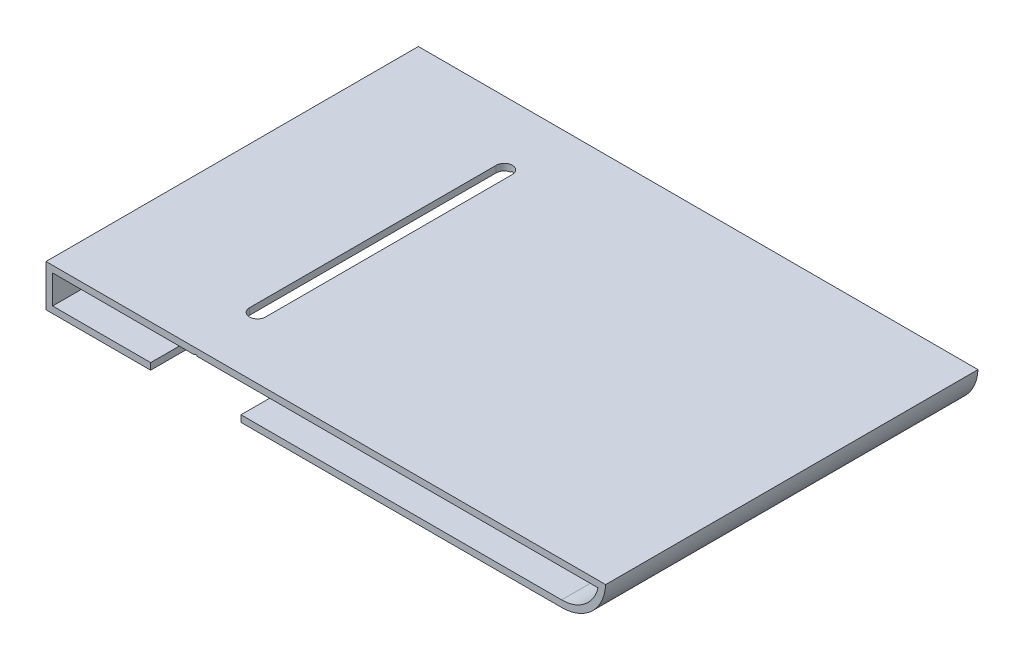
ISO-10303-21;
HEADER;
FILE_DESCRIPTION(('STEP AP214'),'2;1');
FILE_NAME('part.step','',(''),(''),'','','');
FILE_SCHEMA(('AUTOMOTIVE_DESIGN { 1 0 10303 214 1 1 1 1 }'));
ENDSEC;
DATA;
#1=APPLICATION_CONTEXT('core data for automotive mechanical design processes');
#2=APPLICATION_PROTOCOL_DEFINITION('international standard','automotive_design',2000,#1);
#3=PRODUCT_CONTEXT('',#1,'mechanical');
#4=PRODUCT('Part','Part','',(#3));
#5=PRODUCT_RELATED_PRODUCT_CATEGORY('part','',(#4));
#6=PRODUCT_DEFINITION_FORMATION('','',#4);
#7=PRODUCT_DEFINITION_CONTEXT('part definition',#1,'design');
#8=PRODUCT_DEFINITION('design','',#6,#7);
#9=PRODUCT_DEFINITION_SHAPE('','',#8);
#10=(LENGTH_UNIT() NAMED_UNIT(*) SI_UNIT(.MILLI.,.METRE.));
#11=(NAMED_UNIT(*) PLANE_ANGLE_UNIT() SI_UNIT($,.RADIAN.));
#12=(NAMED_UNIT(*) SI_UNIT($,.STERADIAN.) SOLID_ANGLE_UNIT());
#13=UNCERTAINTY_MEASURE_WITH_UNIT(LENGTH_MEASURE(1.E-05),#10,'distance_accuracy_value','');
#14=(GEOMETRIC_REPRESENTATION_CONTEXT(3) GLOBAL_UNCERTAINTY_ASSIGNED_CONTEXT((#13)) GLOBAL_UNIT_ASSIGNED_CONTEXT((#10,
#11,#12)) REPRESENTATION_CONTEXT('',''));
#15=CARTESIAN_POINT('',(0.,0.,0.));
#16=DIRECTION('',(0.,0.,1.));
#17=DIRECTION('',(1.,0.,0.));
#18=AXIS2_PLACEMENT_3D('',#15,#16,#17);
#19=CARTESIAN_POINT('',(66.7,-102.000000000001,100.67082039325));
#20=DIRECTION('',(-0.707106781186531,0.707106781186564,0.));
#21=DIRECTION('',(-0.707106781186564,-0.707106781186531,0.));
#22=AXIS2_PLACEMENT_3D('',#19,#20,#21);
#23=PLANE('',#22);
#24=DIRECTION('',(0.,0.,-1.));
#25=VECTOR('',#24,1.);
#26=CARTESIAN_POINT('',(66.7,-102.000000000001,100.67082039325));
#27=LINE('',#26,#25);
#28=CARTESIAN_POINT('',(66.7,-102.000000000001,-241.5));
#29=VERTEX_POINT('',#28);
#30=CARTESIAN_POINT('',(66.7,-102.000000000001,-253.699826397253));
#31=VERTEX_POINT('',#30);
#32=EDGE_CURVE('E298',#29,#31,#27,.T.);
#33=ORIENTED_EDGE('',*,*,#32,.T.);
#34=CARTESIAN_POINT('',(67.0000000000007,-101.7,-255.5));
#35=DIRECTION('',(-0.707106781186531,0.707106781186564,0.));
#36=DIRECTION('',(0.707106781186564,0.707106781186531,0.));
#37=AXIS2_PLACEMENT_3D('',#34,#35,#36);
#38=ELLIPSE('',#37,2.58093975134183,1.82500000000778);
#39=CARTESIAN_POINT('',(67.,-101.700000000001,-253.674999999992));
#40=VERTEX_POINT('',#39);
#41=EDGE_CURVE('E333',#31,#40,#38,.T.);
#42=ORIENTED_EDGE('',*,*,#41,.T.);
#43=DIRECTION('',(0.,0.,-1.));
#44=VECTOR('',#43,1.);
#45=CARTESIAN_POINT('',(67.,-101.700000000001,100.67082039325));
#46=LINE('',#45,#44);
#47=CARTESIAN_POINT('',(67.,-101.700000000001,-241.5));
#48=VERTEX_POINT('',#47);
#49=EDGE_CURVE('E302',#48,#40,#46,.T.);
#50=ORIENTED_EDGE('',*,*,#49,.F.);
#51=DIRECTION('',(0.707106781186564,0.707106781186531,0.));
#52=VECTOR('',#51,1.);
#53=CARTESIAN_POINT('',(84.3499999999989,-84.3500000000028,-241.5));
#54=LINE('',#53,#52);
#55=EDGE_CURVE('E292',#29,#48,#54,.T.);
#56=ORIENTED_EDGE('',*,*,#55,.F.);
#57=EDGE_LOOP('',(#33,#42,#50,#56));
#58=FACE_BOUND('',#57,.T.);
#59=ADVANCED_FACE('F35',(#58),#23,.F.);
#60=CARTESIAN_POINT('',(67.,-101.700000000001,100.67082039325));
#61=DIRECTION('',(0.707106781186531,0.707106781186564,0.));
#62=DIRECTION('',(-0.707106781186564,0.707106781186531,0.));
#63=AXIS2_PLACEMENT_3D('',#60,#61,#62);
#64=PLANE('',#63);
#65=ORIENTED_EDGE('',*,*,#49,.T.);
#66=CARTESIAN_POINT('',(67.0000000000007,-101.700000000002,-255.5));
#67=DIRECTION('',(0.707106781186531,0.707106781186564,0.));
#68=DIRECTION('',(-0.707106781186564,0.707106781186531,0.));
#69=AXIS2_PLACEMENT_3D('',#66,#67,#68);
#70=ELLIPSE('',#69,2.58093975134185,1.82500000000778);
#71=CARTESIAN_POINT('',(67.3,-102.000000000001,-253.699826397252));
#72=VERTEX_POINT('',#71);
#73=EDGE_CURVE('E204',#40,#72,#70,.T.);
#74=ORIENTED_EDGE('',*,*,#73,.T.);
#75=DIRECTION('',(0.,0.,-1.));
#76=VECTOR('',#75,1.);
#77=CARTESIAN_POINT('',(67.3,-102.000000000001,100.67082039325));
#78=LINE('',#77,#76);
#79=CARTESIAN_POINT('',(67.3,-102.000000000001,-241.5));
#80=VERTEX_POINT('',#79);
#81=EDGE_CURVE('E307',#80,#72,#78,.T.);
#82=ORIENTED_EDGE('',*,*,#81,.F.);
#83=DIRECTION('',(0.707106781186564,-0.707106781186531,0.));
#84=VECTOR('',#83,1.);
#85=CARTESIAN_POINT('',(-17.350000000002,-17.3500000000028,-241.5));
#86=LINE('',#85,#84);
#87=EDGE_CURVE('E295',#48,#80,#86,.T.);
#88=ORIENTED_EDGE('',*,*,#87,.F.);
#89=EDGE_LOOP('',(#65,#74,#82,#88));
#90=FACE_BOUND('',#89,.T.);
#91=ADVANCED_FACE('F422',(#90),#64,.F.);
#92=CARTESIAN_POINT('',(0.,-110.,-421.5));
#93=DIRECTION('',(0.,1.,0.));
#94=DIRECTION('',(-1.,0.,0.));
#95=AXIS2_PLACEMENT_3D('',#92,#93,#94);
#96=PLANE('',#95);
#97=DIRECTION('',(-1.,0.,0.));
#98=VECTOR('',#97,1.);
#99=CARTESIAN_POINT('',(0.,-110.,-241.5));
#100=LINE('',#99,#98);
#101=CARTESIAN_POINT('',(150.012507822281,-110.,-241.5));
#102=VERTEX_POINT('',#101);
#103=CARTESIAN_POINT('',(77.25,-110.,-241.5));
#104=VERTEX_POINT('',#103);
#105=EDGE_CURVE('E246',#102,#104,#100,.T.);
#106=ORIENTED_EDGE('',*,*,#105,.T.);
#107=DIRECTION('',(0.,0.,-1.));
#108=VECTOR('',#107,1.);
#109=CARTESIAN_POINT('',(77.25,-110.,-169.5));
#110=LINE('',#109,#108);
#111=CARTESIAN_POINT('',(77.25,-110.,-326.));
#112=VERTEX_POINT('',#111);
#113=EDGE_CURVE('E320',#104,#112,#110,.T.);
#114=ORIENTED_EDGE('',*,*,#113,.T.);
#115=DIRECTION('',(1.,0.,0.));
#116=VECTOR('',#115,1.);
#117=CARTESIAN_POINT('',(-120.,-110.,-326.));
#118=LINE('',#117,#116);
#119=CARTESIAN_POINT('',(150.012507822281,-110.,-326.));
#120=VERTEX_POINT('',#119);
#121=EDGE_CURVE('E291',#112,#120,#118,.T.);
#122=ORIENTED_EDGE('',*,*,#121,.T.);
#123=DIRECTION('',(0.,0.,1.));
#124=VECTOR('',#123,1.);
#125=CARTESIAN_POINT('',(150.012507822281,-110.,-421.5));
#126=LINE('',#125,#124);
#127=EDGE_CURVE('E238',#120,#102,#126,.T.);
#128=ORIENTED_EDGE('',*,*,#127,.T.);
#129=EDGE_LOOP('',(#106,#114,#122,#128));
#130=FACE_BOUND('',#129,.T.);
#131=ADVANCED_FACE('F391',(#130),#96,.F.);
#132=CARTESIAN_POINT('',(0.,-108.5,-421.5));
#133=DIRECTION('',(0.,1.,0.));
#134=DIRECTION('',(-1.,0.,0.));
#135=AXIS2_PLACEMENT_3D('',#132,#133,#134);
#136=PLANE('',#135);
#137=DIRECTION('',(0.,0.,1.));
#138=VECTOR('',#137,1.);
#139=CARTESIAN_POINT('',(56.75,-108.5,-421.5));
#140=LINE('',#139,#138);
#141=CARTESIAN_POINT('',(56.75,-108.5,-326.));
#142=VERTEX_POINT('',#141);
#143=CARTESIAN_POINT('',(56.75,-108.5,-241.5));
#144=VERTEX_POINT('',#143);
#145=EDGE_CURVE('E312',#142,#144,#140,.T.);
#146=ORIENTED_EDGE('',*,*,#145,.F.);
#147=DIRECTION('',(1.,0.,0.));
#148=VECTOR('',#147,1.);
#149=CARTESIAN_POINT('',(0.,-108.5,-326.));
#150=LINE('',#149,#148);
#151=CARTESIAN_POINT('',(34.5000000000001,-108.5,-326.));
#152=VERTEX_POINT('',#151);
#153=EDGE_CURVE('E278',#152,#142,#150,.T.);
#154=ORIENTED_EDGE('',*,*,#153,.F.);
#155=DIRECTION('',(0.,0.,1.));
#156=VECTOR('',#155,1.);
#157=CARTESIAN_POINT('',(34.5000000000001,-108.5,-421.5));
#158=LINE('',#157,#156);
#159=CARTESIAN_POINT('',(34.5000000000001,-108.5,-241.5));
#160=VERTEX_POINT('',#159);
#161=EDGE_CURVE('E231',#152,#160,#158,.T.);
#162=ORIENTED_EDGE('',*,*,#161,.T.);
#163=DIRECTION('',(-1.,0.,0.));
#164=VECTOR('',#163,1.);
#165=CARTESIAN_POINT('',(0.,-108.5,-241.5));
#166=LINE('',#165,#164);
#167=EDGE_CURVE('E259',#144,#160,#166,.T.);
#168=ORIENTED_EDGE('',*,*,#167,.F.);
#169=EDGE_LOOP('',(#146,#154,#162,#168));
#170=FACE_BOUND('',#169,.T.);
#171=ADVANCED_FACE('F413',(#170),#136,.T.);
#172=CARTESIAN_POINT('',(0.,-102.,-421.5));
#173=DIRECTION('',(0.,-1.,0.));
#174=DIRECTION('',(0.,0.,-1.));
#175=AXIS2_PLACEMENT_3D('',#172,#173,#174);
#176=PLANE('',#175);
#177=CARTESIAN_POINT('',(67.0000000000007,-102.,-255.5));
#178=DIRECTION('',(0.,-1.,0.));
#179=DIRECTION('',(0.,0.,-1.));
#180=AXIS2_PLACEMENT_3D('',#177,#178,#179);
#181=CIRCLE('',#180,1.82500000000778);
#182=CARTESIAN_POINT('',(65.1749999999922,-102.,-255.5));
#183=VERTEX_POINT('',#182);
#184=EDGE_CURVE('E330',#31,#183,#181,.T.);
#185=ORIENTED_EDGE('',*,*,#184,.F.);
#186=ORIENTED_EDGE('',*,*,#32,.F.);
#187=DIRECTION('',(1.,0.,0.));
#188=VECTOR('',#187,1.);
#189=CARTESIAN_POINT('',(0.,-102.,-241.5));
#190=LINE('',#189,#188);
#191=CARTESIAN_POINT('',(34.5000000000001,-102.,-241.5));
#192=VERTEX_POINT('',#191);
#193=EDGE_CURVE('E263',#192,#29,#190,.T.);
#194=ORIENTED_EDGE('',*,*,#193,.F.);
#195=DIRECTION('',(0.,0.,1.));
#196=VECTOR('',#195,1.);
#197=CARTESIAN_POINT('',(34.5000000000001,-102.,-421.5));
#198=LINE('',#197,#196);
#199=CARTESIAN_POINT('',(34.5000000000001,-102.,-326.));
#200=VERTEX_POINT('',#199);
#201=EDGE_CURVE('E229',#200,#192,#198,.T.);
#202=ORIENTED_EDGE('',*,*,#201,.F.);
#203=DIRECTION('',(-1.,0.,0.));
#204=VECTOR('',#203,1.);
#205=CARTESIAN_POINT('',(0.,-102.,-326.));
#206=LINE('',#205,#204);
#207=CARTESIAN_POINT('',(66.7,-102.000000000001,-326.));
#208=VERTEX_POINT('',#207);
#209=EDGE_CURVE('E275',#208,#200,#206,.T.);
#210=ORIENTED_EDGE('',*,*,#209,.F.);
#211=CARTESIAN_POINT('',(66.7,-102.000000000001,-313.300173602747));
#212=VERTEX_POINT('',#211);
#213=EDGE_CURVE('E301',#212,#208,#27,.T.);
#214=ORIENTED_EDGE('',*,*,#213,.F.);
#215=CARTESIAN_POINT('',(67.0000000000007,-102.,-311.5));
#216=DIRECTION('',(0.,-1.,0.));
#217=DIRECTION('',(0.,0.,-1.));
#218=AXIS2_PLACEMENT_3D('',#215,#216,#217);
#219=CIRCLE('',#218,1.82500000000778);
#220=CARTESIAN_POINT('',(65.1749999999922,-102.,-311.5));
#221=VERTEX_POINT('',#220);
#222=EDGE_CURVE('E193',#221,#212,#219,.T.);
#223=ORIENTED_EDGE('',*,*,#222,.F.);
#224=DIRECTION('',(0.,0.,-1.));
#225=VECTOR('',#224,1.);
#226=CARTESIAN_POINT('',(65.1749999999922,-102.,-421.5));
#227=LINE('',#226,#225);
#228=EDGE_CURVE('E323',#183,#221,#227,.T.);
#229=ORIENTED_EDGE('',*,*,#228,.F.);
#230=EDGE_LOOP('',(#185,#186,#194,#202,#210,#214,#223,#229));
#231=FACE_BOUND('',#230,.T.);
#232=ADVANCED_FACE('F357',(#231),#176,.T.);
#233=CARTESIAN_POINT('',(0.,-100.5,-421.5));
#234=DIRECTION('',(0.,-1.,0.));
#235=DIRECTION('',(1.,0.,0.));
#236=AXIS2_PLACEMENT_3D('',#233,#234,#235);
#237=PLANE('',#236);
#238=DIRECTION('',(0.,0.,1.));
#239=VECTOR('',#238,1.);
#240=CARTESIAN_POINT('',(68.8250000000078,-100.5,-421.5));
#241=LINE('',#240,#239);
#242=CARTESIAN_POINT('',(68.8250000000084,-100.5,-311.5));
#243=VERTEX_POINT('',#242);
#244=CARTESIAN_POINT('',(68.8250000000078,-100.5,-255.5));
#245=VERTEX_POINT('',#244);
#246=EDGE_CURVE('E197',#243,#245,#241,.T.);
#247=ORIENTED_EDGE('',*,*,#246,.T.);
#248=CARTESIAN_POINT('',(67.0000000000007,-100.5,-255.5));
#249=DIRECTION('',(0.,-1.,0.));
#250=DIRECTION('',(1.,0.,0.));
#251=AXIS2_PLACEMENT_3D('',#248,#249,#250);
#252=CIRCLE('',#251,1.82500000000778);
#253=CARTESIAN_POINT('',(65.1749999999922,-100.5,-255.5));
#254=VERTEX_POINT('',#253);
#255=EDGE_CURVE('E327',#245,#254,#252,.T.);
#256=ORIENTED_EDGE('',*,*,#255,.T.);
#257=DIRECTION('',(0.,0.,-1.));
#258=VECTOR('',#257,1.);
#259=CARTESIAN_POINT('',(65.1749999999922,-100.5,-421.5));
#260=LINE('',#259,#258);
#261=CARTESIAN_POINT('',(65.1749999999922,-100.5,-311.5));
#262=VERTEX_POINT('',#261);
#263=EDGE_CURVE('E11',#254,#262,#260,.T.);
#264=ORIENTED_EDGE('',*,*,#263,.T.);
#265=CARTESIAN_POINT('',(67.0000000000007,-100.5,-311.5));
#266=DIRECTION('',(0.,-1.,0.));
#267=DIRECTION('',(1.,0.,0.));
#268=AXIS2_PLACEMENT_3D('',#265,#266,#267);
#269=CIRCLE('',#268,1.82500000000778);
#270=EDGE_CURVE('E336',#262,#243,#269,.T.);
#271=ORIENTED_EDGE('',*,*,#270,.T.);
#272=EDGE_LOOP('',(#247,#256,#264,#271));
#273=FACE_BOUND('',#272,.T.);
#274=DIRECTION('',(0.,0.,1.));
#275=VECTOR('',#274,1.);
#276=CARTESIAN_POINT('',(160.,-100.5,-421.5));
#277=LINE('',#276,#275);
#278=CARTESIAN_POINT('',(160.,-100.5,-326.));
#279=VERTEX_POINT('',#278);
#280=CARTESIAN_POINT('',(160.,-100.5,-241.5));
#281=VERTEX_POINT('',#280);
#282=EDGE_CURVE('E224',#279,#281,#277,.T.);
#283=ORIENTED_EDGE('',*,*,#282,.F.);
#284=DIRECTION('',(-1.,0.,0.));
#285=VECTOR('',#284,1.);
#286=CARTESIAN_POINT('',(0.,-100.5,-326.));
#287=LINE('',#286,#285);
#288=CARTESIAN_POINT('',(33.0000000000001,-100.5,-326.));
#289=VERTEX_POINT('',#288);
#290=EDGE_CURVE('E285',#279,#289,#287,.T.);
#291=ORIENTED_EDGE('',*,*,#290,.T.);
#292=DIRECTION('',(0.,0.,1.));
#293=VECTOR('',#292,1.);
#294=CARTESIAN_POINT('',(33.0000000000001,-100.5,-421.5));
#295=LINE('',#294,#293);
#296=CARTESIAN_POINT('',(33.0000000000001,-100.5,-241.5));
#297=VERTEX_POINT('',#296);
#298=EDGE_CURVE('E228',#289,#297,#295,.T.);
#299=ORIENTED_EDGE('',*,*,#298,.T.);
#300=DIRECTION('',(1.,0.,0.));
#301=VECTOR('',#300,1.);
#302=CARTESIAN_POINT('',(0.,-100.5,-241.5));
#303=LINE('',#302,#301);
#304=EDGE_CURVE('E253',#297,#281,#303,.T.);
#305=ORIENTED_EDGE('',*,*,#304,.T.);
#306=EDGE_LOOP('',(#283,#291,#299,#305));
#307=FACE_BOUND('',#306,.T.);
#308=ADVANCED_FACE('F352',(#273,#307),#237,.F.);
#309=CARTESIAN_POINT('',(150.012507822281,-100.,-421.5));
#310=DIRECTION('',(0.,0.,1.));
#311=DIRECTION('',(1.,0.,0.));
#312=AXIS2_PLACEMENT_3D('',#309,#310,#311);
#313=CYLINDRICAL_SURFACE('',#312,10.);
#314=ORIENTED_EDGE('',*,*,#127,.F.);
#315=CARTESIAN_POINT('',(150.012507822281,-100.,-326.));
#316=DIRECTION('',(0.,0.,1.));
#317=DIRECTION('',(1.,0.,0.));
#318=AXIS2_PLACEMENT_3D('',#315,#316,#317);
#319=CIRCLE('',#318,10.);
#320=EDGE_CURVE('E282',#120,#279,#319,.T.);
#321=ORIENTED_EDGE('',*,*,#320,.T.);
#322=ORIENTED_EDGE('',*,*,#282,.T.);
#323=CARTESIAN_POINT('',(150.012507822281,-100.,-241.5));
#324=DIRECTION('',(0.,0.,-1.));
#325=DIRECTION('',(-1.,0.,0.));
#326=AXIS2_PLACEMENT_3D('',#323,#324,#325);
#327=CIRCLE('',#326,10.);
#328=EDGE_CURVE('E250',#281,#102,#327,.T.);
#329=ORIENTED_EDGE('',*,*,#328,.T.);
#330=EDGE_LOOP('',(#314,#321,#322,#329));
#331=FACE_BOUND('',#330,.T.);
#332=ADVANCED_FACE('F448',(#331),#313,.T.);
#333=CARTESIAN_POINT('',(33.0000000000001,-110.,-326.));
#334=VERTEX_POINT('',#333);
#335=CARTESIAN_POINT('',(56.75,-110.,-326.));
#336=VERTEX_POINT('',#335);
#337=EDGE_CURVE('E288',#334,#336,#118,.T.);
#338=ORIENTED_EDGE('',*,*,#337,.T.);
#339=DIRECTION('',(0.,0.,-1.));
#340=VECTOR('',#339,1.);
#341=CARTESIAN_POINT('',(56.75,-110.,-169.5));
#342=LINE('',#341,#340);
#343=CARTESIAN_POINT('',(56.75,-110.,-241.5));
#344=VERTEX_POINT('',#343);
#345=EDGE_CURVE('E319',#344,#336,#342,.T.);
#346=ORIENTED_EDGE('',*,*,#345,.F.);
#347=CARTESIAN_POINT('',(33.0000000000001,-110.,-241.5));
#348=VERTEX_POINT('',#347);
#349=EDGE_CURVE('E249',#344,#348,#100,.T.);
#350=ORIENTED_EDGE('',*,*,#349,.T.);
#351=DIRECTION('',(0.,0.,1.));
#352=VECTOR('',#351,1.);
#353=CARTESIAN_POINT('',(33.0000000000001,-110.,-421.5));
#354=LINE('',#353,#352);
#355=EDGE_CURVE('E240',#334,#348,#354,.T.);
#356=ORIENTED_EDGE('',*,*,#355,.F.);
#357=EDGE_LOOP('',(#338,#346,#350,#356));
#358=FACE_BOUND('',#357,.T.);
#359=ADVANCED_FACE('F405',(#358),#96,.F.);
#360=CARTESIAN_POINT('',(150.012507822281,-100.,-421.5));
#361=DIRECTION('',(0.,0.,1.));
#362=DIRECTION('',(1.,0.,0.));
#363=AXIS2_PLACEMENT_3D('',#360,#361,#362);
#364=CYLINDRICAL_SURFACE('',#363,8.5);
#365=CARTESIAN_POINT('',(150.012507822281,-100.,-326.));
#366=DIRECTION('',(0.,0.,1.));
#367=DIRECTION('',(1.,0.,0.));
#368=AXIS2_PLACEMENT_3D('',#365,#366,#367);
#369=CIRCLE('',#368,8.5);
#370=CARTESIAN_POINT('',(150.012507822281,-108.5,-326.));
#371=VERTEX_POINT('',#370);
#372=CARTESIAN_POINT('',(158.27386364321,-102.,-326.));
#373=VERTEX_POINT('',#372);
#374=EDGE_CURVE('E270',#371,#373,#369,.T.);
#375=ORIENTED_EDGE('',*,*,#374,.F.);
#376=DIRECTION('',(0.,0.,1.));
#377=VECTOR('',#376,1.);
#378=CARTESIAN_POINT('',(150.012507822281,-108.5,-421.5));
#379=LINE('',#378,#377);
#380=CARTESIAN_POINT('',(150.012507822281,-108.5,-241.5));
#381=VERTEX_POINT('',#380);
#382=EDGE_CURVE('E234',#371,#381,#379,.T.);
#383=ORIENTED_EDGE('',*,*,#382,.T.);
#384=CARTESIAN_POINT('',(150.012507822281,-100.,-241.5));
#385=DIRECTION('',(0.,0.,-1.));
#386=DIRECTION('',(-1.,0.,0.));
#387=AXIS2_PLACEMENT_3D('',#384,#385,#386);
#388=CIRCLE('',#387,8.5);
#389=CARTESIAN_POINT('',(158.27386364321,-102.,-241.5));
#390=VERTEX_POINT('',#389);
#391=EDGE_CURVE('E267',#390,#381,#388,.T.);
#392=ORIENTED_EDGE('',*,*,#391,.F.);
#393=DIRECTION('',(0.,0.,1.));
#394=VECTOR('',#393,1.);
#395=CARTESIAN_POINT('',(158.27386364321,-102.,-421.5));
#396=LINE('',#395,#394);
#397=EDGE_CURVE('E225',#373,#390,#396,.T.);
#398=ORIENTED_EDGE('',*,*,#397,.F.);
#399=EDGE_LOOP('',(#375,#383,#392,#398));
#400=FACE_BOUND('',#399,.T.);
#401=ADVANCED_FACE('F37',(#400),#364,.F.);
#402=CARTESIAN_POINT('',(67.0000000000007,-102.,-255.5));
#403=DIRECTION('',(0.,-1.,0.));
#404=DIRECTION('',(0.,0.,-1.));
#405=AXIS2_PLACEMENT_3D('',#402,#403,#404);
#406=CIRCLE('',#405,1.82500000000778);
#407=CARTESIAN_POINT('',(68.8250000000078,-102.,-255.5));
#408=VERTEX_POINT('',#407);
#409=EDGE_CURVE('E203',#408,#72,#406,.T.);
#410=ORIENTED_EDGE('',*,*,#409,.F.);
#411=DIRECTION('',(0.,0.,1.));
#412=VECTOR('',#411,1.);
#413=CARTESIAN_POINT('',(68.8250000000078,-102.,-421.5));
#414=LINE('',#413,#412);
#415=CARTESIAN_POINT('',(68.8250000000084,-102.,-311.5));
#416=VERTEX_POINT('',#415);
#417=EDGE_CURVE('E43',#416,#408,#414,.T.);
#418=ORIENTED_EDGE('',*,*,#417,.F.);
#419=CARTESIAN_POINT('',(67.0000000000007,-102.,-311.5));
#420=DIRECTION('',(0.,-1.,0.));
#421=DIRECTION('',(0.,0.,-1.));
#422=AXIS2_PLACEMENT_3D('',#419,#420,#421);
#423=CIRCLE('',#422,1.82500000000778);
#424=CARTESIAN_POINT('',(67.3,-102.000000000001,-313.300173602747));
#425=VERTEX_POINT('',#424);
#426=EDGE_CURVE('E183',#425,#416,#423,.T.);
#427=ORIENTED_EDGE('',*,*,#426,.F.);
#428=CARTESIAN_POINT('',(67.3,-102.000000000001,-326.));
#429=VERTEX_POINT('',#428);
#430=EDGE_CURVE('E305',#425,#429,#78,.T.);
#431=ORIENTED_EDGE('',*,*,#430,.T.);
#432=EDGE_CURVE('E272',#373,#429,#206,.T.);
#433=ORIENTED_EDGE('',*,*,#432,.F.);
#434=ORIENTED_EDGE('',*,*,#397,.T.);
#435=EDGE_CURVE('E266',#80,#390,#190,.T.);
#436=ORIENTED_EDGE('',*,*,#435,.F.);
#437=ORIENTED_EDGE('',*,*,#81,.T.);
#438=EDGE_LOOP('',(#410,#418,#427,#431,#433,#434,#436,#437));
#439=FACE_BOUND('',#438,.T.);
#440=ADVANCED_FACE('F201',(#439),#176,.T.);
#441=CARTESIAN_POINT('',(34.4999999999994,2.20977082785968E-13,-421.5));
#442=DIRECTION('',(1.,0.,0.));
#443=DIRECTION('',(0.,1.,0.));
#444=AXIS2_PLACEMENT_3D('',#441,#442,#443);
#445=PLANE('',#444);
#446=DIRECTION('',(0.,-1.,0.));
#447=VECTOR('',#446,1.);
#448=CARTESIAN_POINT('',(34.4999999999994,2.20977082785968E-13,-326.));
#449=LINE('',#448,#447);
#450=EDGE_CURVE('E276',#200,#152,#449,.T.);
#451=ORIENTED_EDGE('',*,*,#450,.F.);
#452=ORIENTED_EDGE('',*,*,#201,.T.);
#453=DIRECTION('',(0.,1.,0.));
#454=VECTOR('',#453,1.);
#455=CARTESIAN_POINT('',(34.4999999999994,2.20977082785968E-13,-241.5));
#456=LINE('',#455,#454);
#457=EDGE_CURVE('E260',#160,#192,#456,.T.);
#458=ORIENTED_EDGE('',*,*,#457,.F.);
#459=ORIENTED_EDGE('',*,*,#161,.F.);
#460=EDGE_LOOP('',(#451,#452,#458,#459));
#461=FACE_BOUND('',#460,.T.);
#462=ADVANCED_FACE('F416',(#461),#445,.T.);
#463=DIRECTION('',(0.,0.,-1.));
#464=VECTOR('',#463,1.);
#465=CARTESIAN_POINT('',(77.25,-108.5,-421.5));
#466=LINE('',#465,#464);
#467=CARTESIAN_POINT('',(77.25,-108.5,-241.5));
#468=VERTEX_POINT('',#467);
#469=CARTESIAN_POINT('',(77.25,-108.5,-326.));
#470=VERTEX_POINT('',#469);
#471=EDGE_CURVE('E317',#468,#470,#466,.T.);
#472=ORIENTED_EDGE('',*,*,#471,.F.);
#473=EDGE_CURVE('E256',#381,#468,#166,.T.);
#474=ORIENTED_EDGE('',*,*,#473,.F.);
#475=ORIENTED_EDGE('',*,*,#382,.F.);
#476=EDGE_CURVE('E281',#470,#371,#150,.T.);
#477=ORIENTED_EDGE('',*,*,#476,.F.);
#478=EDGE_LOOP('',(#472,#474,#475,#477));
#479=FACE_BOUND('',#478,.T.);
#480=ADVANCED_FACE('F382',(#479),#136,.T.);
#481=CARTESIAN_POINT('',(32.9999999999995,1.92828209540155E-13,-421.5));
#482=DIRECTION('',(1.,0.,0.));
#483=DIRECTION('',(0.,1.,0.));
#484=AXIS2_PLACEMENT_3D('',#481,#482,#483);
#485=PLANE('',#484);
#486=ORIENTED_EDGE('',*,*,#298,.F.);
#487=DIRECTION('',(0.,-1.,0.));
#488=VECTOR('',#487,1.);
#489=CARTESIAN_POINT('',(32.9999999999995,1.92828209540155E-13,-326.));
#490=LINE('',#489,#488);
#491=EDGE_CURVE('E221',#289,#334,#490,.T.);
#492=ORIENTED_EDGE('',*,*,#491,.T.);
#493=ORIENTED_EDGE('',*,*,#355,.T.);
#494=DIRECTION('',(0.,1.,0.));
#495=VECTOR('',#494,1.);
#496=CARTESIAN_POINT('',(32.9999999999995,1.92828209540155E-13,-241.5));
#497=LINE('',#496,#495);
#498=EDGE_CURVE('E236',#348,#297,#497,.T.);
#499=ORIENTED_EDGE('',*,*,#498,.T.);
#500=EDGE_LOOP('',(#486,#492,#493,#499));
#501=FACE_BOUND('',#500,.T.);
#502=ADVANCED_FACE('F400',(#501),#485,.F.);
#503=CARTESIAN_POINT('',(0.,0.,-241.5));
#504=DIRECTION('',(0.,0.,-1.));
#505=DIRECTION('',(-1.,0.,0.));
#506=AXIS2_PLACEMENT_3D('',#503,#504,#505);
#507=PLANE('',#506);
#508=ORIENTED_EDGE('',*,*,#349,.F.);
#509=DIRECTION('',(0.,1.,0.));
#510=VECTOR('',#509,1.);
#511=CARTESIAN_POINT('',(56.75,0.,-241.5));
#512=LINE('',#511,#510);
#513=EDGE_CURVE('E309',#344,#144,#512,.T.);
#514=ORIENTED_EDGE('',*,*,#513,.T.);
#515=ORIENTED_EDGE('',*,*,#167,.T.);
#516=ORIENTED_EDGE('',*,*,#457,.T.);
#517=ORIENTED_EDGE('',*,*,#193,.T.);
#518=ORIENTED_EDGE('',*,*,#55,.T.);
#519=ORIENTED_EDGE('',*,*,#87,.T.);
#520=ORIENTED_EDGE('',*,*,#435,.T.);
#521=ORIENTED_EDGE('',*,*,#391,.T.);
#522=ORIENTED_EDGE('',*,*,#473,.T.);
#523=DIRECTION('',(0.,-1.,0.));
#524=VECTOR('',#523,1.);
#525=CARTESIAN_POINT('',(77.25,0.,-241.5));
#526=LINE('',#525,#524);
#527=EDGE_CURVE('E314',#468,#104,#526,.T.);
#528=ORIENTED_EDGE('',*,*,#527,.T.);
#529=ORIENTED_EDGE('',*,*,#105,.F.);
#530=ORIENTED_EDGE('',*,*,#328,.F.);
#531=ORIENTED_EDGE('',*,*,#304,.F.);
#532=ORIENTED_EDGE('',*,*,#498,.F.);
#533=EDGE_LOOP('',(#508,#514,#515,#516,#517,#518,#519,#520,#521,#522,#528,#529,#530,#531,#532));
#534=FACE_BOUND('',#533,.T.);
#535=ADVANCED_FACE('F379',(#534),#507,.F.);
#536=CARTESIAN_POINT('',(-120.,-110.,-326.));
#537=DIRECTION('',(0.,0.,1.));
#538=DIRECTION('',(1.,0.,0.));
#539=AXIS2_PLACEMENT_3D('',#536,#537,#538);
#540=PLANE('',#539);
#541=ORIENTED_EDGE('',*,*,#153,.T.);
#542=DIRECTION('',(0.,-1.,0.));
#543=VECTOR('',#542,1.);
#544=CARTESIAN_POINT('',(56.75,-110.,-326.));
#545=LINE('',#544,#543);
#546=EDGE_CURVE('E209',#142,#336,#545,.T.);
#547=ORIENTED_EDGE('',*,*,#546,.T.);
#548=ORIENTED_EDGE('',*,*,#337,.F.);
#549=ORIENTED_EDGE('',*,*,#491,.F.);
#550=ORIENTED_EDGE('',*,*,#290,.F.);
#551=ORIENTED_EDGE('',*,*,#320,.F.);
#552=ORIENTED_EDGE('',*,*,#121,.F.);
#553=DIRECTION('',(0.,1.,0.));
#554=VECTOR('',#553,1.);
#555=CARTESIAN_POINT('',(77.25,-110.,-326.));
#556=LINE('',#555,#554);
#557=EDGE_CURVE('E212',#112,#470,#556,.T.);
#558=ORIENTED_EDGE('',*,*,#557,.T.);
#559=ORIENTED_EDGE('',*,*,#476,.T.);
#560=ORIENTED_EDGE('',*,*,#374,.T.);
#561=ORIENTED_EDGE('',*,*,#432,.T.);
#562=DIRECTION('',(-0.707106781186564,0.707106781186531,0.));
#563=VECTOR('',#562,1.);
#564=CARTESIAN_POINT('',(-22.3500000000047,-12.3500000000003,-326.));
#565=LINE('',#564,#563);
#566=CARTESIAN_POINT('',(67.,-101.700000000001,-326.));
#567=VERTEX_POINT('',#566);
#568=EDGE_CURVE('E218',#429,#567,#565,.T.);
#569=ORIENTED_EDGE('',*,*,#568,.T.);
#570=DIRECTION('',(-0.707106781186564,-0.707106781186531,0.));
#571=VECTOR('',#570,1.);
#572=CARTESIAN_POINT('',(-30.6500000000039,-199.35,-326.));
#573=LINE('',#572,#571);
#574=EDGE_CURVE('E215',#567,#208,#573,.T.);
#575=ORIENTED_EDGE('',*,*,#574,.T.);
#576=ORIENTED_EDGE('',*,*,#209,.T.);
#577=ORIENTED_EDGE('',*,*,#450,.T.);
#578=EDGE_LOOP('',(#541,#547,#548,#549,#550,#551,#552,#558,#559,#560,#561,#569,#575,#576,#577));
#579=FACE_BOUND('',#578,.T.);
#580=ADVANCED_FACE('F387',(#579),#540,.F.);
#581=CARTESIAN_POINT('',(67.,-101.700000000001,-313.325000000008));
#582=VERTEX_POINT('',#581);
#583=EDGE_CURVE('E306',#582,#567,#46,.T.);
#584=ORIENTED_EDGE('',*,*,#583,.F.);
#585=CARTESIAN_POINT('',(67.0000000000007,-101.7,-311.5));
#586=DIRECTION('',(-0.707106781186531,0.707106781186564,0.));
#587=DIRECTION('',(0.707106781186564,0.707106781186531,0.));
#588=AXIS2_PLACEMENT_3D('',#585,#586,#587);
#589=ELLIPSE('',#588,2.58093975134183,1.82500000000778);
#590=EDGE_CURVE('E58',#582,#212,#589,.T.);
#591=ORIENTED_EDGE('',*,*,#590,.T.);
#592=ORIENTED_EDGE('',*,*,#213,.T.);
#593=ORIENTED_EDGE('',*,*,#574,.F.);
#594=EDGE_LOOP('',(#584,#591,#592,#593));
#595=FACE_BOUND('',#594,.T.);
#596=ADVANCED_FACE('F363',(#595),#23,.F.);
#597=ORIENTED_EDGE('',*,*,#430,.F.);
#598=CARTESIAN_POINT('',(67.0000000000007,-101.700000000002,-311.5));
#599=DIRECTION('',(0.707106781186531,0.707106781186564,0.));
#600=DIRECTION('',(-0.707106781186564,0.707106781186531,0.));
#601=AXIS2_PLACEMENT_3D('',#598,#599,#600);
#602=ELLIPSE('',#601,2.58093975134185,1.82500000000778);
#603=EDGE_CURVE('E189',#425,#582,#602,.T.);
#604=ORIENTED_EDGE('',*,*,#603,.T.);
#605=ORIENTED_EDGE('',*,*,#583,.T.);
#606=ORIENTED_EDGE('',*,*,#568,.F.);
#607=EDGE_LOOP('',(#597,#604,#605,#606));
#608=FACE_BOUND('',#607,.T.);
#609=ADVANCED_FACE('F367',(#608),#64,.F.);
#610=CARTESIAN_POINT('',(77.25,-110.,-169.5));
#611=DIRECTION('',(1.,0.,0.));
#612=DIRECTION('',(0.,0.,-1.));
#613=AXIS2_PLACEMENT_3D('',#610,#611,#612);
#614=PLANE('',#613);
#615=ORIENTED_EDGE('',*,*,#471,.T.);
#616=ORIENTED_EDGE('',*,*,#557,.F.);
#617=ORIENTED_EDGE('',*,*,#113,.F.);
#618=ORIENTED_EDGE('',*,*,#527,.F.);
#619=EDGE_LOOP('',(#615,#616,#617,#618));
#620=FACE_BOUND('',#619,.T.);
#621=ADVANCED_FACE('F385',(#620),#614,.F.);
#622=CARTESIAN_POINT('',(56.75,-110.,-169.5));
#623=DIRECTION('',(-1.,0.,0.));
#624=DIRECTION('',(0.,0.,1.));
#625=AXIS2_PLACEMENT_3D('',#622,#623,#624);
#626=PLANE('',#625);
#627=ORIENTED_EDGE('',*,*,#345,.T.);
#628=ORIENTED_EDGE('',*,*,#546,.F.);
#629=ORIENTED_EDGE('',*,*,#145,.T.);
#630=ORIENTED_EDGE('',*,*,#513,.F.);
#631=EDGE_LOOP('',(#627,#628,#629,#630));
#632=FACE_BOUND('',#631,.T.);
#633=ADVANCED_FACE('F407',(#632),#626,.F.);
#634=CARTESIAN_POINT('',(65.1749999999923,-110.000000000001,-255.5));
#635=DIRECTION('',(-1.,0.,0.));
#636=DIRECTION('',(0.,-1.,0.));
#637=AXIS2_PLACEMENT_3D('',#634,#635,#636);
#638=PLANE('',#637);
#639=ORIENTED_EDGE('',*,*,#228,.T.);
#640=DIRECTION('',(0.,1.,0.));
#641=VECTOR('',#640,1.);
#642=CARTESIAN_POINT('',(65.1749999999923,-110.000000000001,-311.5));
#643=LINE('',#642,#641);
#644=EDGE_CURVE('E198',#221,#262,#643,.T.);
#645=ORIENTED_EDGE('',*,*,#644,.T.);
#646=ORIENTED_EDGE('',*,*,#263,.F.);
#647=DIRECTION('',(0.,1.,0.));
#648=VECTOR('',#647,1.);
#649=CARTESIAN_POINT('',(65.1749999999923,-110.000000000001,-255.5));
#650=LINE('',#649,#648);
#651=EDGE_CURVE('E340',#183,#254,#650,.T.);
#652=ORIENTED_EDGE('',*,*,#651,.F.);
#653=EDGE_LOOP('',(#639,#645,#646,#652));
#654=FACE_BOUND('',#653,.T.);
#655=ADVANCED_FACE('F355',(#654),#638,.F.);
#656=CARTESIAN_POINT('',(68.8250000000078,-110.000000000001,-311.5));
#657=DIRECTION('',(1.,0.,0.));
#658=DIRECTION('',(0.,1.,0.));
#659=AXIS2_PLACEMENT_3D('',#656,#657,#658);
#660=PLANE('',#659);
#661=DIRECTION('',(0.,1.,0.));
#662=VECTOR('',#661,1.);
#663=CARTESIAN_POINT('',(68.8250000000085,-110.000000000001,-311.5));
#664=LINE('',#663,#662);
#665=EDGE_CURVE('E187',#416,#243,#664,.T.);
#666=ORIENTED_EDGE('',*,*,#665,.F.);
#667=ORIENTED_EDGE('',*,*,#417,.T.);
#668=DIRECTION('',(0.,1.,0.));
#669=VECTOR('',#668,1.);
#670=CARTESIAN_POINT('',(68.8250000000078,-110.000000000001,-255.5));
#671=LINE('',#670,#669);
#672=EDGE_CURVE('E50',#408,#245,#671,.T.);
#673=ORIENTED_EDGE('',*,*,#672,.T.);
#674=ORIENTED_EDGE('',*,*,#246,.F.);
#675=EDGE_LOOP('',(#666,#667,#673,#674));
#676=FACE_BOUND('',#675,.T.);
#677=ADVANCED_FACE('F195',(#676),#660,.F.);
#678=CARTESIAN_POINT('',(67.0000000000007,-110.000000000001,-255.5));
#679=DIRECTION('',(0.,1.,0.));
#680=DIRECTION('',(-1.,0.,0.));
#681=AXIS2_PLACEMENT_3D('',#678,#679,#680);
#682=CYLINDRICAL_SURFACE('',#681,1.82500000000778);
#683=ORIENTED_EDGE('',*,*,#672,.F.);
#684=ORIENTED_EDGE('',*,*,#409,.T.);
#685=ORIENTED_EDGE('',*,*,#73,.F.);
#686=ORIENTED_EDGE('',*,*,#41,.F.);
#687=ORIENTED_EDGE('',*,*,#184,.T.);
#688=ORIENTED_EDGE('',*,*,#651,.T.);
#689=ORIENTED_EDGE('',*,*,#255,.F.);
#690=EDGE_LOOP('',(#683,#684,#685,#686,#687,#688,#689));
#691=FACE_BOUND('',#690,.T.);
#692=ADVANCED_FACE('F347',(#691),#682,.F.);
#693=CARTESIAN_POINT('',(67.0000000000007,-110.000000000001,-311.5));
#694=DIRECTION('',(0.,1.,0.));
#695=DIRECTION('',(-1.,0.,0.));
#696=AXIS2_PLACEMENT_3D('',#693,#694,#695);
#697=CYLINDRICAL_SURFACE('',#696,1.82500000000778);
#698=ORIENTED_EDGE('',*,*,#644,.F.);
#699=ORIENTED_EDGE('',*,*,#222,.T.);
#700=ORIENTED_EDGE('',*,*,#590,.F.);
#701=ORIENTED_EDGE('',*,*,#603,.F.);
#702=ORIENTED_EDGE('',*,*,#426,.T.);
#703=ORIENTED_EDGE('',*,*,#665,.T.);
#704=ORIENTED_EDGE('',*,*,#270,.F.);
#705=EDGE_LOOP('',(#698,#699,#700,#701,#702,#703,#704));
#706=FACE_BOUND('',#705,.T.);
#707=ADVANCED_FACE('F186',(#706),#697,.F.);
#708=CLOSED_SHELL('',(#59,#91,#131,#171,#232,#308,#332,#359,#401,#440,#462,#480,#502,#535,#580,
#596,#609,#621,#633,#655,#677,#692,#707));
#709=MANIFOLD_SOLID_BREP('B2',#708);
#710=ADVANCED_BREP_SHAPE_REPRESENTATION('',(#18,#709),#14);
#711=SHAPE_DEFINITION_REPRESENTATION(#9,#710);
ENDSEC;
END-ISO-10303-21;
